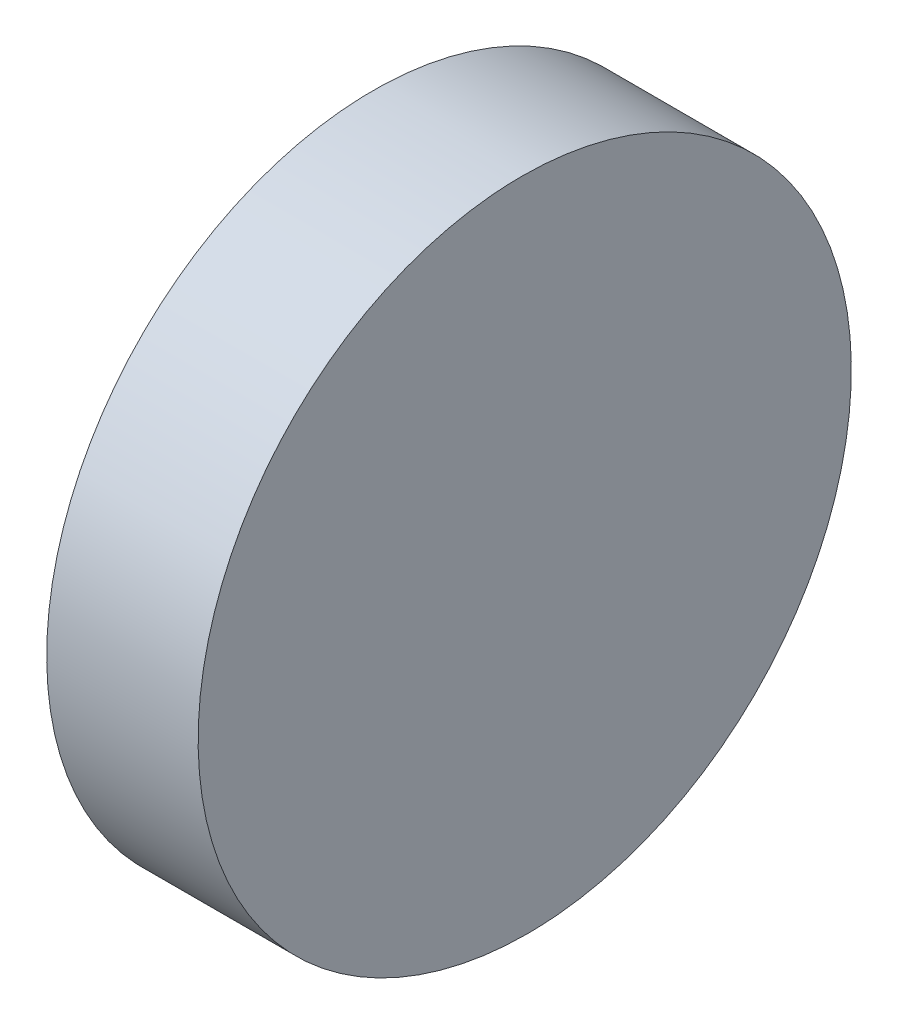
ISO-10303-21;
HEADER;
FILE_DESCRIPTION(('STEP AP214'),'2;1');
FILE_NAME('part.step','',(''),(''),'','','');
FILE_SCHEMA(('AUTOMOTIVE_DESIGN { 1 0 10303 214 1 1 1 1 }'));
ENDSEC;
DATA;
#1=APPLICATION_CONTEXT('core data for automotive mechanical design processes');
#2=APPLICATION_PROTOCOL_DEFINITION('international standard','automotive_design',2000,#1);
#3=PRODUCT_CONTEXT('',#1,'mechanical');
#4=PRODUCT('Part','Part','',(#3));
#5=PRODUCT_RELATED_PRODUCT_CATEGORY('part','',(#4));
#6=PRODUCT_DEFINITION_FORMATION('','',#4);
#7=PRODUCT_DEFINITION_CONTEXT('part definition',#1,'design');
#8=PRODUCT_DEFINITION('design','',#6,#7);
#9=PRODUCT_DEFINITION_SHAPE('','',#8);
#10=(LENGTH_UNIT() NAMED_UNIT(*) SI_UNIT(.MILLI.,.METRE.));
#11=(NAMED_UNIT(*) PLANE_ANGLE_UNIT() SI_UNIT($,.RADIAN.));
#12=(NAMED_UNIT(*) SI_UNIT($,.STERADIAN.) SOLID_ANGLE_UNIT());
#13=UNCERTAINTY_MEASURE_WITH_UNIT(LENGTH_MEASURE(1.E-05),#10,'distance_accuracy_value','');
#14=(GEOMETRIC_REPRESENTATION_CONTEXT(3) GLOBAL_UNCERTAINTY_ASSIGNED_CONTEXT((#13)) GLOBAL_UNIT_ASSIGNED_CONTEXT((#10,
#11,#12)) REPRESENTATION_CONTEXT('',''));
#15=CARTESIAN_POINT('',(0.,0.,0.));
#16=DIRECTION('',(0.,0.,1.));
#17=DIRECTION('',(1.,0.,0.));
#18=AXIS2_PLACEMENT_3D('',#15,#16,#17);
#19=CARTESIAN_POINT('',(0.,12.7,25.4));
#20=DIRECTION('',(1.,0.,0.));
#21=DIRECTION('',(0.,1.,0.));
#22=AXIS2_PLACEMENT_3D('',#19,#20,#21);
#23=PLANE('',#22);
#24=CARTESIAN_POINT('',(0.,0.,12.7));
#25=DIRECTION('',(-1.,0.,0.));
#26=DIRECTION('',(0.,-1.,0.));
#27=AXIS2_PLACEMENT_3D('',#24,#25,#26);
#28=CIRCLE('',#27,12.7);
#29=CARTESIAN_POINT('',(0.,-12.7,12.7));
#30=VERTEX_POINT('',#29);
#31=EDGE_CURVE('E112',#30,#30,#28,.T.);
#32=ORIENTED_EDGE('',*,*,#31,.T.);
#33=EDGE_LOOP('',(#32));
#34=FACE_BOUND('',#33,.T.);
#35=ADVANCED_FACE('F105',(#34),#23,.F.);
#36=CARTESIAN_POINT('',(6.,-12.7,25.4));
#37=DIRECTION('',(-0.999961923064172,-0.008726535498367,0.));
#38=DIRECTION('',(0.008726535498367,-0.999961923064171,0.));
#39=AXIS2_PLACEMENT_3D('',#36,#37,#38);
#40=PLANE('',#39);
#41=CARTESIAN_POINT('',(5.88916877905745,0.,12.7));
#42=DIRECTION('',(-0.999961923064172,-0.008726535498367,0.));
#43=DIRECTION('',(-0.008726535498367,0.999961923064171,0.));
#44=AXIS2_PLACEMENT_3D('',#41,#42,#43);
#45=ELLIPSE('',#44,12.7004835954989,12.7);
#46=CARTESIAN_POINT('',(5.77833755811491,12.7,12.7));
#47=VERTEX_POINT('',#46);
#48=EDGE_CURVE('E11',#47,#47,#45,.T.);
#49=ORIENTED_EDGE('',*,*,#48,.F.);
#50=EDGE_LOOP('',(#49));
#51=FACE_BOUND('',#50,.T.);
#52=ADVANCED_FACE('F107',(#51),#40,.F.);
#53=CARTESIAN_POINT('',(10.,0.,12.7));
#54=DIRECTION('',(-1.,0.,0.));
#55=DIRECTION('',(0.,-1.,0.));
#56=AXIS2_PLACEMENT_3D('',#53,#54,#55);
#57=CYLINDRICAL_SURFACE('',#56,12.7);
#58=ORIENTED_EDGE('',*,*,#31,.F.);
#59=EDGE_LOOP('',(#58));
#60=FACE_BOUND('',#59,.T.);
#61=ORIENTED_EDGE('',*,*,#48,.T.);
#62=EDGE_LOOP('',(#61));
#63=FACE_BOUND('',#62,.T.);
#64=ADVANCED_FACE('F119',(#60,#63),#57,.T.);
#65=CLOSED_SHELL('',(#35,#52,#64));
#66=MANIFOLD_SOLID_BREP('B2',#65);
#67=ADVANCED_BREP_SHAPE_REPRESENTATION('',(#18,#66),#14);
#68=SHAPE_DEFINITION_REPRESENTATION(#9,#67);
ENDSEC;
END-ISO-10303-21;
